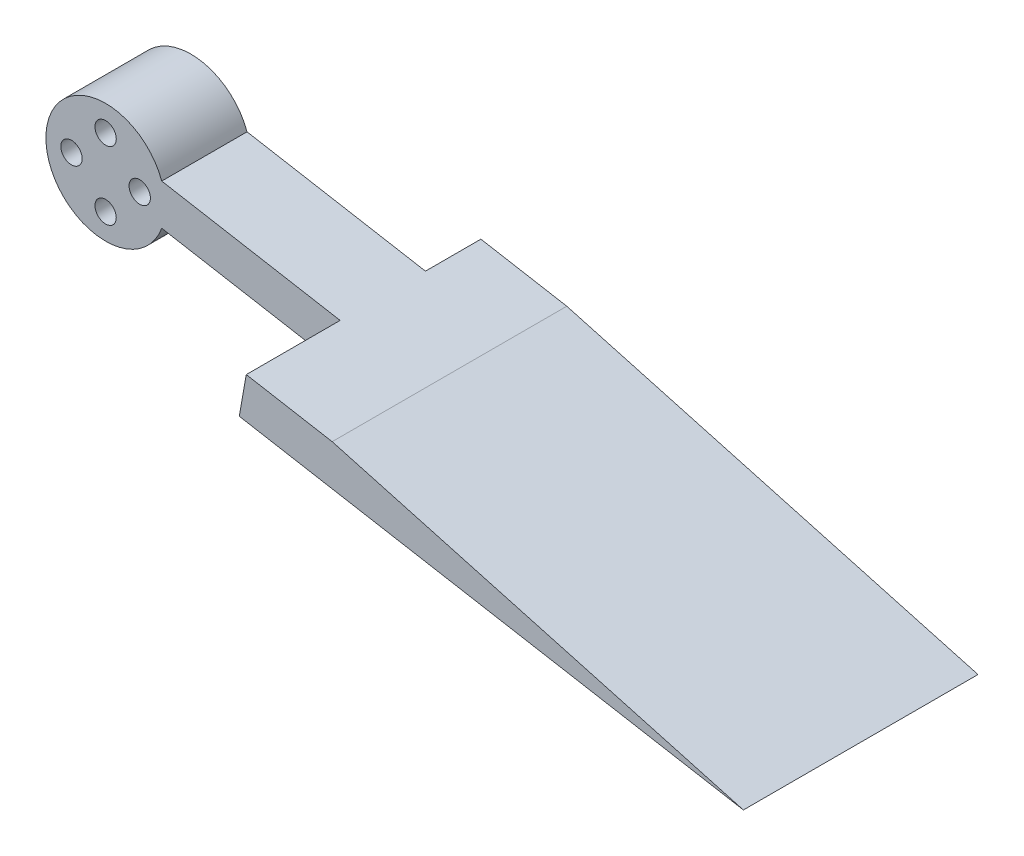
ISO-10303-21;
HEADER;
FILE_DESCRIPTION(('STEP AP214'),'2;1');
FILE_NAME('part.step','',(''),(''),'','','');
FILE_SCHEMA(('AUTOMOTIVE_DESIGN { 1 0 10303 214 1 1 1 1 }'));
ENDSEC;
DATA;
#1=APPLICATION_CONTEXT('core data for automotive mechanical design processes');
#2=APPLICATION_PROTOCOL_DEFINITION('international standard','automotive_design',2000,#1);
#3=PRODUCT_CONTEXT('',#1,'mechanical');
#4=PRODUCT('Part','Part','',(#3));
#5=PRODUCT_RELATED_PRODUCT_CATEGORY('part','',(#4));
#6=PRODUCT_DEFINITION_FORMATION('','',#4);
#7=PRODUCT_DEFINITION_CONTEXT('part definition',#1,'design');
#8=PRODUCT_DEFINITION('design','',#6,#7);
#9=PRODUCT_DEFINITION_SHAPE('','',#8);
#10=(LENGTH_UNIT() NAMED_UNIT(*) SI_UNIT(.MILLI.,.METRE.));
#11=(NAMED_UNIT(*) PLANE_ANGLE_UNIT() SI_UNIT($,.RADIAN.));
#12=(NAMED_UNIT(*) SI_UNIT($,.STERADIAN.) SOLID_ANGLE_UNIT());
#13=UNCERTAINTY_MEASURE_WITH_UNIT(LENGTH_MEASURE(1.E-05),#10,'distance_accuracy_value','');
#14=(GEOMETRIC_REPRESENTATION_CONTEXT(3) GLOBAL_UNCERTAINTY_ASSIGNED_CONTEXT((#13)) GLOBAL_UNIT_ASSIGNED_CONTEXT((#10,
#11,#12)) REPRESENTATION_CONTEXT('',''));
#15=CARTESIAN_POINT('',(0.,0.,0.));
#16=DIRECTION('',(0.,0.,1.));
#17=DIRECTION('',(1.,0.,0.));
#18=AXIS2_PLACEMENT_3D('',#15,#16,#17);
#19=CARTESIAN_POINT('',(0.,0.,10.));
#20=DIRECTION('',(0.,0.,-1.));
#21=DIRECTION('',(-1.,0.,0.));
#22=AXIS2_PLACEMENT_3D('',#19,#20,#21);
#23=CYLINDRICAL_SURFACE('',#22,7.);
#24=CARTESIAN_POINT('',(0.,0.,0.));
#25=DIRECTION('',(0.,0.,1.));
#26=DIRECTION('',(1.,0.,0.));
#27=AXIS2_PLACEMENT_3D('',#24,#25,#26);
#28=CIRCLE('',#27,7.);
#29=CARTESIAN_POINT('',(6.57784834550136,2.39414100327969,0.));
#30=VERTEX_POINT('',#29);
#31=CARTESIAN_POINT('',(6.57784834550136,-2.39414100327969,0.));
#32=VERTEX_POINT('',#31);
#33=EDGE_CURVE('E158',#30,#32,#28,.T.);
#34=ORIENTED_EDGE('',*,*,#33,.T.);
#35=DIRECTION('',(0.,0.,-1.));
#36=VECTOR('',#35,1.);
#37=CARTESIAN_POINT('',(6.57784834550136,-2.39414100327969,10.));
#38=LINE('',#37,#36);
#39=CARTESIAN_POINT('',(6.57784834550136,-2.39414100327969,10.));
#40=VERTEX_POINT('',#39);
#41=EDGE_CURVE('E52',#40,#32,#38,.T.);
#42=ORIENTED_EDGE('',*,*,#41,.F.);
#43=CARTESIAN_POINT('',(0.,0.,10.));
#44=DIRECTION('',(0.,0.,1.));
#45=DIRECTION('',(1.,0.,0.));
#46=AXIS2_PLACEMENT_3D('',#43,#44,#45);
#47=CIRCLE('',#46,7.);
#48=CARTESIAN_POINT('',(6.57784834550136,2.39414100327969,10.));
#49=VERTEX_POINT('',#48);
#50=EDGE_CURVE('E159',#49,#40,#47,.T.);
#51=ORIENTED_EDGE('',*,*,#50,.F.);
#52=DIRECTION('',(0.,0.,-1.));
#53=VECTOR('',#52,1.);
#54=CARTESIAN_POINT('',(6.57784834550136,2.39414100327969,10.));
#55=LINE('',#54,#53);
#56=EDGE_CURVE('E168',#49,#30,#55,.T.);
#57=ORIENTED_EDGE('',*,*,#56,.T.);
#58=EDGE_LOOP('',(#34,#42,#51,#57));
#59=FACE_BOUND('',#58,.T.);
#60=ADVANCED_FACE('F43',(#59),#23,.T.);
#61=CARTESIAN_POINT('',(85.7590038964178,-16.3559150905801,10.));
#62=DIRECTION('',(0.173648177666931,0.984807753012208,0.));
#63=DIRECTION('',(-0.984807753012208,0.173648177666931,0.));
#64=AXIS2_PLACEMENT_3D('',#61,#62,#63);
#65=PLANE('',#64);
#66=DIRECTION('',(0.984807753012208,-0.173648177666931,0.));
#67=VECTOR('',#66,1.);
#68=CARTESIAN_POINT('',(85.7590038964178,-16.3559150905801,0.));
#69=LINE('',#68,#67);
#70=CARTESIAN_POINT('',(26.6705387156853,-5.93702443056427,0.));
#71=VERTEX_POINT('',#70);
#72=EDGE_CURVE('E172',#32,#71,#69,.T.);
#73=ORIENTED_EDGE('',*,*,#72,.T.);
#74=DIRECTION('',(0.,0.,1.));
#75=VECTOR('',#74,1.);
#76=CARTESIAN_POINT('',(26.6705387156853,-5.93702443056427,-6.5));
#77=LINE('',#76,#75);
#78=CARTESIAN_POINT('',(26.6705387156853,-5.93702443056427,-6.5));
#79=VERTEX_POINT('',#78);
#80=EDGE_CURVE('E148',#79,#71,#77,.T.);
#81=ORIENTED_EDGE('',*,*,#80,.F.);
#82=DIRECTION('',(0.984807753012208,-0.17364817766693,0.));
#83=VECTOR('',#82,1.);
#84=CARTESIAN_POINT('',(26.6705387156853,-5.93702443056427,-6.5));
#85=LINE('',#84,#83);
#86=CARTESIAN_POINT('',(85.7590038964178,-16.3559150905801,-6.5));
#87=VERTEX_POINT('',#86);
#88=EDGE_CURVE('E138',#79,#87,#85,.T.);
#89=ORIENTED_EDGE('',*,*,#88,.T.);
#90=DIRECTION('',(0.,0.,-1.));
#91=VECTOR('',#90,1.);
#92=CARTESIAN_POINT('',(85.7590038964178,-16.3559150905801,10.));
#93=LINE('',#92,#91);
#94=CARTESIAN_POINT('',(85.7590038964178,-16.3559150905801,21.));
#95=VERTEX_POINT('',#94);
#96=EDGE_CURVE('E112',#95,#87,#93,.T.);
#97=ORIENTED_EDGE('',*,*,#96,.F.);
#98=DIRECTION('',(0.984807753012208,-0.17364817766693,0.));
#99=VECTOR('',#98,1.);
#100=CARTESIAN_POINT('',(26.6705387156853,-5.93702443056427,21.));
#101=LINE('',#100,#99);
#102=CARTESIAN_POINT('',(26.6705387156853,-5.93702443056427,21.));
#103=VERTEX_POINT('',#102);
#104=EDGE_CURVE('E134',#103,#95,#101,.T.);
#105=ORIENTED_EDGE('',*,*,#104,.F.);
#106=CARTESIAN_POINT('',(26.6705387156853,-5.93702443056427,10.));
#107=VERTEX_POINT('',#106);
#108=EDGE_CURVE('E152',#107,#103,#77,.T.);
#109=ORIENTED_EDGE('',*,*,#108,.F.);
#110=DIRECTION('',(0.984807753012208,-0.173648177666931,0.));
#111=VECTOR('',#110,1.);
#112=CARTESIAN_POINT('',(85.7590038964178,-16.3559150905801,10.));
#113=LINE('',#112,#111);
#114=EDGE_CURVE('E68',#40,#107,#113,.T.);
#115=ORIENTED_EDGE('',*,*,#114,.F.);
#116=ORIENTED_EDGE('',*,*,#41,.T.);
#117=EDGE_LOOP('',(#73,#81,#89,#97,#105,#109,#115,#116));
#118=FACE_BOUND('',#117,.T.);
#119=ADVANCED_FACE('F230',(#118),#65,.F.);
#120=CARTESIAN_POINT('',(6.57784834550136,2.39414100327969,10.));
#121=DIRECTION('',(-0.173648177666931,-0.984807753012208,0.));
#122=DIRECTION('',(0.984807753012208,-0.173648177666931,0.));
#123=AXIS2_PLACEMENT_3D('',#120,#121,#122);
#124=PLANE('',#123);
#125=DIRECTION('',(-0.984807753012208,0.17364817766693,0.));
#126=VECTOR('',#125,1.);
#127=CARTESIAN_POINT('',(86.5778483455014,-11.7120174533975,21.));
#128=LINE('',#127,#126);
#129=CARTESIAN_POINT('',(37.556934536008,-3.06830772979965,21.));
#130=VERTEX_POINT('',#129);
#131=CARTESIAN_POINT('',(27.4893831647689,-1.2931267933817,21.));
#132=VERTEX_POINT('',#131);
#133=EDGE_CURVE('E126',#130,#132,#128,.T.);
#134=ORIENTED_EDGE('',*,*,#133,.F.);
#135=DIRECTION('',(0.,0.,1.));
#136=VECTOR('',#135,1.);
#137=CARTESIAN_POINT('',(37.5569345360082,-3.0683077297997,-6.5));
#138=LINE('',#137,#136);
#139=CARTESIAN_POINT('',(37.5569345360082,-3.0683077297997,-6.5));
#140=VERTEX_POINT('',#139);
#141=EDGE_CURVE('E60',#140,#130,#138,.T.);
#142=ORIENTED_EDGE('',*,*,#141,.F.);
#143=DIRECTION('',(-0.984807753012208,0.17364817766693,0.));
#144=VECTOR('',#143,1.);
#145=CARTESIAN_POINT('',(86.5778483455014,-11.7120174533975,-6.5));
#146=LINE('',#145,#144);
#147=CARTESIAN_POINT('',(27.4893831647689,-1.2931267933817,-6.5));
#148=VERTEX_POINT('',#147);
#149=EDGE_CURVE('E123',#140,#148,#146,.T.);
#150=ORIENTED_EDGE('',*,*,#149,.T.);
#151=DIRECTION('',(0.,0.,1.));
#152=VECTOR('',#151,1.);
#153=CARTESIAN_POINT('',(27.4893831647689,-1.2931267933817,-6.5));
#154=LINE('',#153,#152);
#155=CARTESIAN_POINT('',(27.4893831647689,-1.2931267933817,0.));
#156=VERTEX_POINT('',#155);
#157=EDGE_CURVE('E153',#148,#156,#154,.T.);
#158=ORIENTED_EDGE('',*,*,#157,.T.);
#159=DIRECTION('',(-0.984807753012208,0.173648177666931,0.));
#160=VECTOR('',#159,1.);
#161=CARTESIAN_POINT('',(6.57784834550136,2.39414100327969,0.));
#162=LINE('',#161,#160);
#163=EDGE_CURVE('E162',#156,#30,#162,.T.);
#164=ORIENTED_EDGE('',*,*,#163,.T.);
#165=ORIENTED_EDGE('',*,*,#56,.F.);
#166=DIRECTION('',(-0.984807753012208,0.173648177666931,0.));
#167=VECTOR('',#166,1.);
#168=CARTESIAN_POINT('',(6.57784834550136,2.39414100327969,10.));
#169=LINE('',#168,#167);
#170=CARTESIAN_POINT('',(27.4893831647689,-1.2931267933817,10.));
#171=VERTEX_POINT('',#170);
#172=EDGE_CURVE('E165',#171,#49,#169,.T.);
#173=ORIENTED_EDGE('',*,*,#172,.F.);
#174=EDGE_CURVE('E147',#171,#132,#154,.T.);
#175=ORIENTED_EDGE('',*,*,#174,.T.);
#176=EDGE_LOOP('',(#134,#142,#150,#158,#164,#165,#173,#175));
#177=FACE_BOUND('',#176,.T.);
#178=ADVANCED_FACE('F122',(#177),#124,.F.);
#179=CARTESIAN_POINT('',(0.,0.,10.));
#180=DIRECTION('',(0.,0.,1.));
#181=DIRECTION('',(1.,0.,0.));
#182=AXIS2_PLACEMENT_3D('',#179,#180,#181);
#183=PLANE('',#182);
#184=CARTESIAN_POINT('',(0.,4.,10.));
#185=DIRECTION('',(0.,0.,1.));
#186=DIRECTION('',(1.,0.,0.));
#187=AXIS2_PLACEMENT_3D('',#184,#185,#186);
#188=CIRCLE('',#187,1.24999999999999);
#189=CARTESIAN_POINT('',(1.24999999999999,4.,10.));
#190=VERTEX_POINT('',#189);
#191=EDGE_CURVE('E211',#190,#190,#188,.T.);
#192=ORIENTED_EDGE('',*,*,#191,.F.);
#193=EDGE_LOOP('',(#192));
#194=FACE_BOUND('',#193,.T.);
#195=CARTESIAN_POINT('',(4.,0.,10.));
#196=DIRECTION('',(0.,0.,1.));
#197=DIRECTION('',(1.,0.,0.));
#198=AXIS2_PLACEMENT_3D('',#195,#196,#197);
#199=CIRCLE('',#198,1.24999999999999);
#200=CARTESIAN_POINT('',(5.24999999999999,0.,10.));
#201=VERTEX_POINT('',#200);
#202=EDGE_CURVE('E198',#201,#201,#199,.T.);
#203=ORIENTED_EDGE('',*,*,#202,.F.);
#204=EDGE_LOOP('',(#203));
#205=FACE_BOUND('',#204,.T.);
#206=CARTESIAN_POINT('',(0.,-4.,10.));
#207=DIRECTION('',(0.,0.,1.));
#208=DIRECTION('',(1.,0.,0.));
#209=AXIS2_PLACEMENT_3D('',#206,#207,#208);
#210=CIRCLE('',#209,1.24999999999999);
#211=CARTESIAN_POINT('',(1.24999999999999,-4.,10.));
#212=VERTEX_POINT('',#211);
#213=EDGE_CURVE('E194',#212,#212,#210,.T.);
#214=ORIENTED_EDGE('',*,*,#213,.F.);
#215=EDGE_LOOP('',(#214));
#216=FACE_BOUND('',#215,.T.);
#217=CARTESIAN_POINT('',(-4.,0.,10.));
#218=DIRECTION('',(0.,0.,1.));
#219=DIRECTION('',(1.,0.,0.));
#220=AXIS2_PLACEMENT_3D('',#217,#218,#219);
#221=CIRCLE('',#220,1.24999999999999);
#222=CARTESIAN_POINT('',(-2.75000000000001,0.,10.));
#223=VERTEX_POINT('',#222);
#224=EDGE_CURVE('E190',#223,#223,#221,.T.);
#225=ORIENTED_EDGE('',*,*,#224,.F.);
#226=EDGE_LOOP('',(#225));
#227=FACE_BOUND('',#226,.T.);
#228=DIRECTION('',(-0.173648177666931,-0.984807753012208,0.));
#229=VECTOR('',#228,1.);
#230=CARTESIAN_POINT('',(26.8816145429346,-4.73995392892443,10.));
#231=LINE('',#230,#229);
#232=EDGE_CURVE('E151',#171,#107,#231,.T.);
#233=ORIENTED_EDGE('',*,*,#232,.F.);
#234=ORIENTED_EDGE('',*,*,#172,.T.);
#235=ORIENTED_EDGE('',*,*,#50,.T.);
#236=ORIENTED_EDGE('',*,*,#114,.T.);
#237=EDGE_LOOP('',(#233,#234,#235,#236));
#238=FACE_BOUND('',#237,.T.);
#239=ADVANCED_FACE('F242',(#194,#205,#216,#227,#238),#183,.T.);
#240=CARTESIAN_POINT('',(0.,0.,0.));
#241=DIRECTION('',(0.,0.,1.));
#242=DIRECTION('',(1.,0.,0.));
#243=AXIS2_PLACEMENT_3D('',#240,#241,#242);
#244=PLANE('',#243);
#245=CARTESIAN_POINT('',(0.,4.,0.));
#246=DIRECTION('',(0.,0.,1.));
#247=DIRECTION('',(1.,0.,0.));
#248=AXIS2_PLACEMENT_3D('',#245,#246,#247);
#249=CIRCLE('',#248,1.24999999999999);
#250=CARTESIAN_POINT('',(1.24999999999999,4.,0.));
#251=VERTEX_POINT('',#250);
#252=EDGE_CURVE('E46',#251,#251,#249,.T.);
#253=ORIENTED_EDGE('',*,*,#252,.T.);
#254=EDGE_LOOP('',(#253));
#255=FACE_BOUND('',#254,.T.);
#256=CARTESIAN_POINT('',(4.,0.,0.));
#257=DIRECTION('',(0.,0.,1.));
#258=DIRECTION('',(1.,0.,0.));
#259=AXIS2_PLACEMENT_3D('',#256,#257,#258);
#260=CIRCLE('',#259,1.24999999999999);
#261=CARTESIAN_POINT('',(5.24999999999999,0.,0.));
#262=VERTEX_POINT('',#261);
#263=EDGE_CURVE('E195',#262,#262,#260,.T.);
#264=ORIENTED_EDGE('',*,*,#263,.T.);
#265=EDGE_LOOP('',(#264));
#266=FACE_BOUND('',#265,.T.);
#267=CARTESIAN_POINT('',(0.,-4.,0.));
#268=DIRECTION('',(0.,0.,1.));
#269=DIRECTION('',(1.,0.,0.));
#270=AXIS2_PLACEMENT_3D('',#267,#268,#269);
#271=CIRCLE('',#270,1.24999999999999);
#272=CARTESIAN_POINT('',(1.24999999999999,-4.,0.));
#273=VERTEX_POINT('',#272);
#274=EDGE_CURVE('E191',#273,#273,#271,.T.);
#275=ORIENTED_EDGE('',*,*,#274,.T.);
#276=EDGE_LOOP('',(#275));
#277=FACE_BOUND('',#276,.T.);
#278=CARTESIAN_POINT('',(-4.,0.,0.));
#279=DIRECTION('',(0.,0.,1.));
#280=DIRECTION('',(1.,0.,0.));
#281=AXIS2_PLACEMENT_3D('',#278,#279,#280);
#282=CIRCLE('',#281,1.24999999999999);
#283=CARTESIAN_POINT('',(-2.75000000000001,0.,0.));
#284=VERTEX_POINT('',#283);
#285=EDGE_CURVE('E186',#284,#284,#282,.T.);
#286=ORIENTED_EDGE('',*,*,#285,.T.);
#287=EDGE_LOOP('',(#286));
#288=FACE_BOUND('',#287,.T.);
#289=ORIENTED_EDGE('',*,*,#163,.F.);
#290=DIRECTION('',(-0.173648177666931,-0.984807753012208,0.));
#291=VECTOR('',#290,1.);
#292=CARTESIAN_POINT('',(26.8816145429346,-4.73995392892443,0.));
#293=LINE('',#292,#291);
#294=EDGE_CURVE('E11',#156,#71,#293,.T.);
#295=ORIENTED_EDGE('',*,*,#294,.T.);
#296=ORIENTED_EDGE('',*,*,#72,.F.);
#297=ORIENTED_EDGE('',*,*,#33,.F.);
#298=EDGE_LOOP('',(#289,#295,#296,#297));
#299=FACE_BOUND('',#298,.T.);
#300=ADVANCED_FACE('F241',(#255,#266,#277,#288,#299),#244,.F.);
#301=CARTESIAN_POINT('',(0.,0.,-6.5));
#302=DIRECTION('',(0.,0.,1.));
#303=DIRECTION('',(1.,0.,0.));
#304=AXIS2_PLACEMENT_3D('',#301,#302,#303);
#305=PLANE('',#304);
#306=ORIENTED_EDGE('',*,*,#149,.F.);
#307=DIRECTION('',(0.964041387208191,-0.265752147215608,0.));
#308=VECTOR('',#307,1.);
#309=CARTESIAN_POINT('',(85.7590038964178,-16.3559150905801,-6.5));
#310=LINE('',#309,#308);
#311=EDGE_CURVE('E109',#140,#87,#310,.T.);
#312=ORIENTED_EDGE('',*,*,#311,.T.);
#313=ORIENTED_EDGE('',*,*,#88,.F.);
#314=DIRECTION('',(-0.173648177666931,-0.984807753012208,0.));
#315=VECTOR('',#314,1.);
#316=CARTESIAN_POINT('',(27.4893831647689,-1.2931267933817,-6.5));
#317=LINE('',#316,#315);
#318=EDGE_CURVE('E132',#148,#79,#317,.T.);
#319=ORIENTED_EDGE('',*,*,#318,.F.);
#320=EDGE_LOOP('',(#306,#312,#313,#319));
#321=FACE_BOUND('',#320,.T.);
#322=ADVANCED_FACE('F130',(#321),#305,.F.);
#323=CARTESIAN_POINT('',(27.4893831647689,-1.2931267933817,-6.5));
#324=DIRECTION('',(-0.984807753012208,0.173648177666931,0.));
#325=DIRECTION('',(-0.173648177666931,-0.984807753012208,0.));
#326=AXIS2_PLACEMENT_3D('',#323,#324,#325);
#327=PLANE('',#326);
#328=ORIENTED_EDGE('',*,*,#294,.F.);
#329=ORIENTED_EDGE('',*,*,#157,.F.);
#330=ORIENTED_EDGE('',*,*,#318,.T.);
#331=ORIENTED_EDGE('',*,*,#80,.T.);
#332=EDGE_LOOP('',(#328,#329,#330,#331));
#333=FACE_BOUND('',#332,.T.);
#334=ADVANCED_FACE('F233',(#333),#327,.T.);
#335=ORIENTED_EDGE('',*,*,#174,.F.);
#336=ORIENTED_EDGE('',*,*,#232,.T.);
#337=ORIENTED_EDGE('',*,*,#108,.T.);
#338=DIRECTION('',(-0.173648177666931,-0.984807753012208,0.));
#339=VECTOR('',#338,1.);
#340=CARTESIAN_POINT('',(27.4893831647689,-1.2931267933817,21.));
#341=LINE('',#340,#339);
#342=EDGE_CURVE('E141',#132,#103,#341,.T.);
#343=ORIENTED_EDGE('',*,*,#342,.F.);
#344=EDGE_LOOP('',(#335,#336,#337,#343));
#345=FACE_BOUND('',#344,.T.);
#346=ADVANCED_FACE('F245',(#345),#327,.T.);
#347=CARTESIAN_POINT('',(0.,0.,21.));
#348=DIRECTION('',(0.,0.,1.));
#349=DIRECTION('',(1.,0.,0.));
#350=AXIS2_PLACEMENT_3D('',#347,#348,#349);
#351=PLANE('',#350);
#352=DIRECTION('',(0.964041387208191,-0.265752147215608,0.));
#353=VECTOR('',#352,1.);
#354=CARTESIAN_POINT('',(85.7590038964178,-16.3559150905801,21.));
#355=LINE('',#354,#353);
#356=EDGE_CURVE('E118',#130,#95,#355,.T.);
#357=ORIENTED_EDGE('',*,*,#356,.F.);
#358=ORIENTED_EDGE('',*,*,#133,.T.);
#359=ORIENTED_EDGE('',*,*,#342,.T.);
#360=ORIENTED_EDGE('',*,*,#104,.T.);
#361=EDGE_LOOP('',(#357,#358,#359,#360));
#362=FACE_BOUND('',#361,.T.);
#363=ADVANCED_FACE('F225',(#362),#351,.T.);
#364=CARTESIAN_POINT('',(85.7590038964178,-16.3559150905801,-6.5));
#365=DIRECTION('',(-0.265752147215608,-0.964041387208191,0.));
#366=DIRECTION('',(0.964041387208191,-0.265752147215608,0.));
#367=AXIS2_PLACEMENT_3D('',#364,#365,#366);
#368=PLANE('',#367);
#369=ORIENTED_EDGE('',*,*,#356,.T.);
#370=ORIENTED_EDGE('',*,*,#96,.T.);
#371=ORIENTED_EDGE('',*,*,#311,.F.);
#372=ORIENTED_EDGE('',*,*,#141,.T.);
#373=EDGE_LOOP('',(#369,#370,#371,#372));
#374=FACE_BOUND('',#373,.T.);
#375=ADVANCED_FACE('F110',(#374),#368,.F.);
#376=CARTESIAN_POINT('',(-4.,0.,10.));
#377=DIRECTION('',(0.,0.,1.));
#378=DIRECTION('',(1.,0.,0.));
#379=AXIS2_PLACEMENT_3D('',#376,#377,#378);
#380=CYLINDRICAL_SURFACE('',#379,1.24999999999999);
#381=ORIENTED_EDGE('',*,*,#224,.T.);
#382=EDGE_LOOP('',(#381));
#383=FACE_BOUND('',#382,.T.);
#384=ORIENTED_EDGE('',*,*,#285,.F.);
#385=EDGE_LOOP('',(#384));
#386=FACE_BOUND('',#385,.T.);
#387=ADVANCED_FACE('F278',(#383,#386),#380,.F.);
#388=CARTESIAN_POINT('',(0.,-4.,10.));
#389=DIRECTION('',(0.,0.,1.));
#390=DIRECTION('',(1.,0.,0.));
#391=AXIS2_PLACEMENT_3D('',#388,#389,#390);
#392=CYLINDRICAL_SURFACE('',#391,1.24999999999999);
#393=ORIENTED_EDGE('',*,*,#213,.T.);
#394=EDGE_LOOP('',(#393));
#395=FACE_BOUND('',#394,.T.);
#396=ORIENTED_EDGE('',*,*,#274,.F.);
#397=EDGE_LOOP('',(#396));
#398=FACE_BOUND('',#397,.T.);
#399=ADVANCED_FACE('F281',(#395,#398),#392,.F.);
#400=CARTESIAN_POINT('',(4.,0.,10.));
#401=DIRECTION('',(0.,0.,1.));
#402=DIRECTION('',(1.,0.,0.));
#403=AXIS2_PLACEMENT_3D('',#400,#401,#402);
#404=CYLINDRICAL_SURFACE('',#403,1.24999999999999);
#405=ORIENTED_EDGE('',*,*,#202,.T.);
#406=EDGE_LOOP('',(#405));
#407=FACE_BOUND('',#406,.T.);
#408=ORIENTED_EDGE('',*,*,#263,.F.);
#409=EDGE_LOOP('',(#408));
#410=FACE_BOUND('',#409,.T.);
#411=ADVANCED_FACE('F289',(#407,#410),#404,.F.);
#412=CARTESIAN_POINT('',(0.,4.,10.));
#413=DIRECTION('',(0.,0.,1.));
#414=DIRECTION('',(1.,0.,0.));
#415=AXIS2_PLACEMENT_3D('',#412,#413,#414);
#416=CYLINDRICAL_SURFACE('',#415,1.24999999999999);
#417=ORIENTED_EDGE('',*,*,#191,.T.);
#418=EDGE_LOOP('',(#417));
#419=FACE_BOUND('',#418,.T.);
#420=ORIENTED_EDGE('',*,*,#252,.F.);
#421=EDGE_LOOP('',(#420));
#422=FACE_BOUND('',#421,.T.);
#423=ADVANCED_FACE('F366',(#419,#422),#416,.F.);
#424=CLOSED_SHELL('',(#60,#119,#178,#239,#300,#322,#334,#346,#363,#375,#387,#399,#411,#423));
#425=MANIFOLD_SOLID_BREP('B2',#424);
#426=ADVANCED_BREP_SHAPE_REPRESENTATION('',(#18,#425),#14);
#427=SHAPE_DEFINITION_REPRESENTATION(#9,#426);
ENDSEC;
END-ISO-10303-21;
